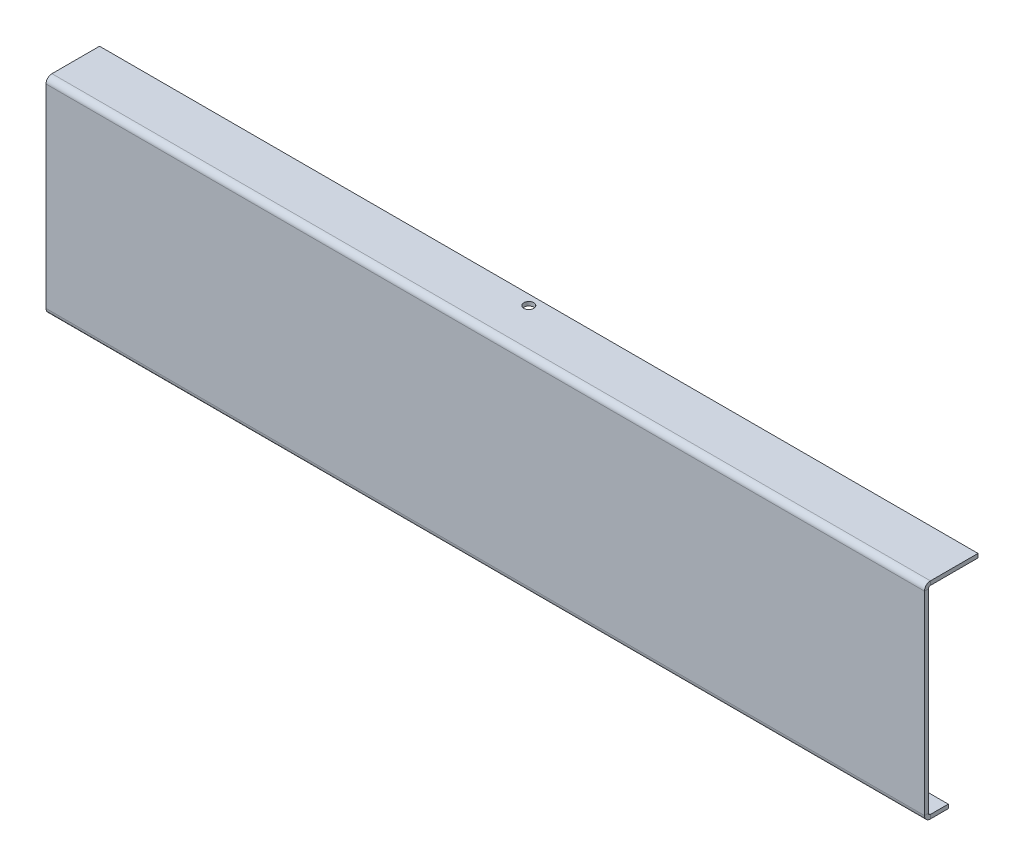
ISO-10303-21;
HEADER;
FILE_DESCRIPTION(('STEP AP214'),'2;1');
FILE_NAME('part.step','',(''),(''),'','','');
FILE_SCHEMA(('AUTOMOTIVE_DESIGN { 1 0 10303 214 1 1 1 1 }'));
ENDSEC;
DATA;
#1=APPLICATION_CONTEXT('core data for automotive mechanical design processes');
#2=APPLICATION_PROTOCOL_DEFINITION('international standard','automotive_design',2000,#1);
#3=PRODUCT_CONTEXT('',#1,'mechanical');
#4=PRODUCT('Part','Part','',(#3));
#5=PRODUCT_RELATED_PRODUCT_CATEGORY('part','',(#4));
#6=PRODUCT_DEFINITION_FORMATION('','',#4);
#7=PRODUCT_DEFINITION_CONTEXT('part definition',#1,'design');
#8=PRODUCT_DEFINITION('design','',#6,#7);
#9=PRODUCT_DEFINITION_SHAPE('','',#8);
#10=(LENGTH_UNIT() NAMED_UNIT(*) SI_UNIT(.MILLI.,.METRE.));
#11=(NAMED_UNIT(*) PLANE_ANGLE_UNIT() SI_UNIT($,.RADIAN.));
#12=(NAMED_UNIT(*) SI_UNIT($,.STERADIAN.) SOLID_ANGLE_UNIT());
#13=UNCERTAINTY_MEASURE_WITH_UNIT(LENGTH_MEASURE(1.E-05),#10,'distance_accuracy_value','');
#14=(GEOMETRIC_REPRESENTATION_CONTEXT(3) GLOBAL_UNCERTAINTY_ASSIGNED_CONTEXT((#13)) GLOBAL_UNIT_ASSIGNED_CONTEXT((#10,
#11,#12)) REPRESENTATION_CONTEXT('',''));
#15=CARTESIAN_POINT('',(0.,0.,0.));
#16=DIRECTION('',(0.,0.,1.));
#17=DIRECTION('',(1.,0.,0.));
#18=AXIS2_PLACEMENT_3D('',#15,#16,#17);
#19=CARTESIAN_POINT('',(0.,0.,-2.));
#20=DIRECTION('',(0.,0.,1.));
#21=DIRECTION('',(1.,0.,0.));
#22=AXIS2_PLACEMENT_3D('',#19,#20,#21);
#23=PLANE('',#22);
#24=DIRECTION('',(-1.,0.,0.));
#25=VECTOR('',#24,1.);
#26=CARTESIAN_POINT('',(-221.5,-49.,-2.));
#27=LINE('',#26,#25);
#28=CARTESIAN_POINT('',(-221.5,-49.,-2.));
#29=VERTEX_POINT('',#28);
#30=CARTESIAN_POINT('',(221.5,-49.,-2.));
#31=VERTEX_POINT('',#30);
#32=EDGE_CURVE('E224',#29,#31,#27,.F.);
#33=ORIENTED_EDGE('',*,*,#32,.F.);
#34=DIRECTION('',(0.,-1.,0.));
#35=VECTOR('',#34,1.);
#36=CARTESIAN_POINT('',(-221.5,50.,-2.));
#37=LINE('',#36,#35);
#38=CARTESIAN_POINT('',(-221.5,49.,-1.99999999999998));
#39=VERTEX_POINT('',#38);
#40=EDGE_CURVE('E12',#39,#29,#37,.T.);
#41=ORIENTED_EDGE('',*,*,#40,.F.);
#42=DIRECTION('',(1.,0.,0.));
#43=VECTOR('',#42,1.);
#44=CARTESIAN_POINT('',(221.5,49.,-1.99999999999998));
#45=LINE('',#44,#43);
#46=CARTESIAN_POINT('',(221.5,49.,-1.99999999999998));
#47=VERTEX_POINT('',#46);
#48=EDGE_CURVE('E115',#47,#39,#45,.F.);
#49=ORIENTED_EDGE('',*,*,#48,.F.);
#50=DIRECTION('',(0.,1.,0.));
#51=VECTOR('',#50,1.);
#52=CARTESIAN_POINT('',(221.5,50.,-2.));
#53=LINE('',#52,#51);
#54=EDGE_CURVE('E54',#31,#47,#53,.T.);
#55=ORIENTED_EDGE('',*,*,#54,.F.);
#56=EDGE_LOOP('',(#33,#41,#49,#55));
#57=FACE_BOUND('',#56,.T.);
#58=ADVANCED_FACE('F44',(#57),#23,.F.);
#59=CARTESIAN_POINT('',(0.,0.,0.));
#60=DIRECTION('',(0.,0.,1.));
#61=DIRECTION('',(1.,0.,0.));
#62=AXIS2_PLACEMENT_3D('',#59,#60,#61);
#63=PLANE('',#62);
#64=DIRECTION('',(0.,-1.,0.));
#65=VECTOR('',#64,1.);
#66=CARTESIAN_POINT('',(-221.5,50.,0.));
#67=LINE('',#66,#65);
#68=CARTESIAN_POINT('',(-221.5,49.,0.));
#69=VERTEX_POINT('',#68);
#70=CARTESIAN_POINT('',(-221.5,-49.,0.));
#71=VERTEX_POINT('',#70);
#72=EDGE_CURVE('E185',#69,#71,#67,.T.);
#73=ORIENTED_EDGE('',*,*,#72,.T.);
#74=DIRECTION('',(-1.,0.,0.));
#75=VECTOR('',#74,1.);
#76=CARTESIAN_POINT('',(-221.5,-49.,0.));
#77=LINE('',#76,#75);
#78=CARTESIAN_POINT('',(221.5,-49.,0.));
#79=VERTEX_POINT('',#78);
#80=EDGE_CURVE('E196',#71,#79,#77,.F.);
#81=ORIENTED_EDGE('',*,*,#80,.T.);
#82=DIRECTION('',(0.,1.,0.));
#83=VECTOR('',#82,1.);
#84=CARTESIAN_POINT('',(221.5,50.,0.));
#85=LINE('',#84,#83);
#86=CARTESIAN_POINT('',(221.5,49.,0.));
#87=VERTEX_POINT('',#86);
#88=EDGE_CURVE('E71',#79,#87,#85,.T.);
#89=ORIENTED_EDGE('',*,*,#88,.T.);
#90=DIRECTION('',(1.,0.,0.));
#91=VECTOR('',#90,1.);
#92=CARTESIAN_POINT('',(221.5,49.,0.));
#93=LINE('',#92,#91);
#94=EDGE_CURVE('E167',#87,#69,#93,.F.);
#95=ORIENTED_EDGE('',*,*,#94,.T.);
#96=EDGE_LOOP('',(#73,#81,#89,#95));
#97=FACE_BOUND('',#96,.T.);
#98=ADVANCED_FACE('F193',(#97),#63,.T.);
#99=CARTESIAN_POINT('',(-221.5,50.,-2.));
#100=DIRECTION('',(-1.,0.,0.));
#101=DIRECTION('',(0.,0.,1.));
#102=AXIS2_PLACEMENT_3D('',#99,#100,#101);
#103=PLANE('',#102);
#104=ORIENTED_EDGE('',*,*,#40,.T.);
#105=DIRECTION('',(0.,0.,1.));
#106=VECTOR('',#105,1.);
#107=CARTESIAN_POINT('',(-221.5,-49.,-2.));
#108=LINE('',#107,#106);
#109=EDGE_CURVE('E205',#29,#71,#108,.T.);
#110=ORIENTED_EDGE('',*,*,#109,.T.);
#111=ORIENTED_EDGE('',*,*,#72,.F.);
#112=DIRECTION('',(0.,0.,1.));
#113=VECTOR('',#112,1.);
#114=CARTESIAN_POINT('',(-221.5,49.,-1.99999999999998));
#115=LINE('',#114,#113);
#116=EDGE_CURVE('E179',#39,#69,#115,.T.);
#117=ORIENTED_EDGE('',*,*,#116,.F.);
#118=EDGE_LOOP('',(#104,#110,#111,#117));
#119=FACE_BOUND('',#118,.T.);
#120=ADVANCED_FACE('F202',(#119),#103,.T.);
#121=CARTESIAN_POINT('',(221.5,50.,-2.));
#122=DIRECTION('',(1.,0.,0.));
#123=DIRECTION('',(0.,1.,0.));
#124=AXIS2_PLACEMENT_3D('',#121,#122,#123);
#125=PLANE('',#124);
#126=DIRECTION('',(0.,0.,1.));
#127=VECTOR('',#126,1.);
#128=CARTESIAN_POINT('',(221.5,-49.,-2.));
#129=LINE('',#128,#127);
#130=EDGE_CURVE('E145',#31,#79,#129,.T.);
#131=ORIENTED_EDGE('',*,*,#130,.F.);
#132=ORIENTED_EDGE('',*,*,#54,.T.);
#133=DIRECTION('',(0.,0.,1.));
#134=VECTOR('',#133,1.);
#135=CARTESIAN_POINT('',(221.5,49.,-1.99999999999998));
#136=LINE('',#135,#134);
#137=EDGE_CURVE('E113',#47,#87,#136,.T.);
#138=ORIENTED_EDGE('',*,*,#137,.T.);
#139=ORIENTED_EDGE('',*,*,#88,.F.);
#140=EDGE_LOOP('',(#131,#132,#138,#139));
#141=FACE_BOUND('',#140,.T.);
#142=ADVANCED_FACE('F46',(#141),#125,.T.);
#143=CARTESIAN_POINT('',(-221.5,49.,-2.99999999999999));
#144=DIRECTION('',(-1.,0.,0.));
#145=DIRECTION('',(0.,0.,1.));
#146=AXIS2_PLACEMENT_3D('',#143,#144,#145);
#147=PLANE('',#146);
#148=DIRECTION('',(0.,1.,0.));
#149=VECTOR('',#148,1.);
#150=CARTESIAN_POINT('',(-221.5,50.,-3.));
#151=LINE('',#150,#149);
#152=CARTESIAN_POINT('',(-221.5,50.,-2.99999999999999));
#153=VERTEX_POINT('',#152);
#154=CARTESIAN_POINT('',(-221.5,52.,-2.99999999999998));
#155=VERTEX_POINT('',#154);
#156=EDGE_CURVE('E103',#153,#155,#151,.T.);
#157=ORIENTED_EDGE('',*,*,#156,.F.);
#158=CARTESIAN_POINT('',(-221.5,49.,-2.99999999999999));
#159=DIRECTION('',(1.,0.,0.));
#160=DIRECTION('',(0.,0.,-1.));
#161=AXIS2_PLACEMENT_3D('',#158,#159,#160);
#162=CIRCLE('',#161,1.00000000000001);
#163=EDGE_CURVE('E96',#39,#153,#162,.F.);
#164=ORIENTED_EDGE('',*,*,#163,.F.);
#165=ORIENTED_EDGE('',*,*,#116,.T.);
#166=CARTESIAN_POINT('',(-221.5,49.,-2.99999999999999));
#167=DIRECTION('',(1.,0.,0.));
#168=DIRECTION('',(0.,0.,-1.));
#169=AXIS2_PLACEMENT_3D('',#166,#167,#168);
#170=CIRCLE('',#169,3.00000000000001);
#171=EDGE_CURVE('E62',#69,#155,#170,.F.);
#172=ORIENTED_EDGE('',*,*,#171,.T.);
#173=EDGE_LOOP('',(#157,#164,#165,#172));
#174=FACE_BOUND('',#173,.T.);
#175=ADVANCED_FACE('F322',(#174),#147,.T.);
#176=CARTESIAN_POINT('',(221.5,49.,-2.99999999999999));
#177=DIRECTION('',(-1.,0.,0.));
#178=DIRECTION('',(0.,0.,1.));
#179=AXIS2_PLACEMENT_3D('',#176,#177,#178);
#180=PLANE('',#179);
#181=CARTESIAN_POINT('',(221.5,49.,-2.99999999999999));
#182=DIRECTION('',(1.,0.,0.));
#183=DIRECTION('',(0.,0.,-1.));
#184=AXIS2_PLACEMENT_3D('',#181,#182,#183);
#185=CIRCLE('',#184,1.00000000000001);
#186=CARTESIAN_POINT('',(221.5,50.,-2.99999999999999));
#187=VERTEX_POINT('',#186);
#188=EDGE_CURVE('E93',#187,#47,#185,.T.);
#189=ORIENTED_EDGE('',*,*,#188,.F.);
#190=DIRECTION('',(0.,1.,0.));
#191=VECTOR('',#190,1.);
#192=CARTESIAN_POINT('',(221.5,50.,-2.99999999999998));
#193=LINE('',#192,#191);
#194=CARTESIAN_POINT('',(221.5,52.,-2.99999999999998));
#195=VERTEX_POINT('',#194);
#196=EDGE_CURVE('E102',#187,#195,#193,.T.);
#197=ORIENTED_EDGE('',*,*,#196,.T.);
#198=CARTESIAN_POINT('',(221.5,49.,-2.99999999999999));
#199=DIRECTION('',(1.,0.,0.));
#200=DIRECTION('',(0.,0.,-1.));
#201=AXIS2_PLACEMENT_3D('',#198,#199,#200);
#202=CIRCLE('',#201,3.00000000000001);
#203=EDGE_CURVE('E170',#195,#87,#202,.T.);
#204=ORIENTED_EDGE('',*,*,#203,.T.);
#205=ORIENTED_EDGE('',*,*,#137,.F.);
#206=EDGE_LOOP('',(#189,#197,#204,#205));
#207=FACE_BOUND('',#206,.T.);
#208=ADVANCED_FACE('F108',(#207),#180,.F.);
#209=CARTESIAN_POINT('',(221.5,49.,-2.99999999999999));
#210=DIRECTION('',(1.,0.,0.));
#211=DIRECTION('',(0.,1.,0.));
#212=AXIS2_PLACEMENT_3D('',#209,#210,#211);
#213=CYLINDRICAL_SURFACE('',#212,3.00000000000001);
#214=ORIENTED_EDGE('',*,*,#94,.F.);
#215=ORIENTED_EDGE('',*,*,#203,.F.);
#216=DIRECTION('',(1.,0.,0.));
#217=VECTOR('',#216,1.);
#218=CARTESIAN_POINT('',(0.,52.,-2.99999999999998));
#219=LINE('',#218,#217);
#220=EDGE_CURVE('E135',#155,#195,#219,.T.);
#221=ORIENTED_EDGE('',*,*,#220,.F.);
#222=ORIENTED_EDGE('',*,*,#171,.F.);
#223=EDGE_LOOP('',(#214,#215,#221,#222));
#224=FACE_BOUND('',#223,.T.);
#225=ADVANCED_FACE('F415',(#224),#213,.T.);
#226=CARTESIAN_POINT('',(221.5,49.,-2.99999999999999));
#227=DIRECTION('',(1.,0.,0.));
#228=DIRECTION('',(0.,1.,0.));
#229=AXIS2_PLACEMENT_3D('',#226,#227,#228);
#230=CYLINDRICAL_SURFACE('',#229,1.00000000000001);
#231=ORIENTED_EDGE('',*,*,#48,.T.);
#232=ORIENTED_EDGE('',*,*,#163,.T.);
#233=DIRECTION('',(1.,0.,0.));
#234=VECTOR('',#233,1.);
#235=CARTESIAN_POINT('',(-221.5,50.,-3.));
#236=LINE('',#235,#234);
#237=EDGE_CURVE('E90',#153,#187,#236,.T.);
#238=ORIENTED_EDGE('',*,*,#237,.T.);
#239=ORIENTED_EDGE('',*,*,#188,.T.);
#240=EDGE_LOOP('',(#231,#232,#238,#239));
#241=FACE_BOUND('',#240,.T.);
#242=ADVANCED_FACE('F92',(#241),#230,.F.);
#243=CARTESIAN_POINT('',(221.5,52.,-1.99999999999999));
#244=DIRECTION('',(1.,0.,0.));
#245=DIRECTION('',(0.,0.,-1.));
#246=AXIS2_PLACEMENT_3D('',#243,#244,#245);
#247=PLANE('',#246);
#248=DIRECTION('',(0.,0.,1.));
#249=VECTOR('',#248,1.);
#250=CARTESIAN_POINT('',(221.5,52.,-1.99999999999999));
#251=LINE('',#250,#249);
#252=CARTESIAN_POINT('',(221.5,52.0000000000001,-27.));
#253=VERTEX_POINT('',#252);
#254=EDGE_CURVE('E133',#253,#195,#251,.T.);
#255=ORIENTED_EDGE('',*,*,#254,.T.);
#256=ORIENTED_EDGE('',*,*,#196,.F.);
#257=DIRECTION('',(0.,0.,1.));
#258=VECTOR('',#257,1.);
#259=CARTESIAN_POINT('',(221.5,50.,-2.));
#260=LINE('',#259,#258);
#261=CARTESIAN_POINT('',(221.5,50.0000000000001,-27.));
#262=VERTEX_POINT('',#261);
#263=EDGE_CURVE('E120',#262,#187,#260,.T.);
#264=ORIENTED_EDGE('',*,*,#263,.F.);
#265=DIRECTION('',(0.,-1.,0.));
#266=VECTOR('',#265,1.);
#267=CARTESIAN_POINT('',(221.5,52.0000000000001,-27.));
#268=LINE('',#267,#266);
#269=EDGE_CURVE('E116',#253,#262,#268,.T.);
#270=ORIENTED_EDGE('',*,*,#269,.F.);
#271=EDGE_LOOP('',(#255,#256,#264,#270));
#272=FACE_BOUND('',#271,.T.);
#273=ADVANCED_FACE('F131',(#272),#247,.T.);
#274=CARTESIAN_POINT('',(-221.5,52.0000000000001,-27.));
#275=DIRECTION('',(-1.,0.,0.));
#276=DIRECTION('',(0.,0.,1.));
#277=AXIS2_PLACEMENT_3D('',#274,#275,#276);
#278=PLANE('',#277);
#279=DIRECTION('',(0.,0.,-1.));
#280=VECTOR('',#279,1.);
#281=CARTESIAN_POINT('',(-221.5,50.0000000000001,-27.));
#282=LINE('',#281,#280);
#283=CARTESIAN_POINT('',(-221.5,50.0000000000001,-27.));
#284=VERTEX_POINT('',#283);
#285=EDGE_CURVE('E139',#153,#284,#282,.T.);
#286=ORIENTED_EDGE('',*,*,#285,.F.);
#287=ORIENTED_EDGE('',*,*,#156,.T.);
#288=DIRECTION('',(0.,0.,-1.));
#289=VECTOR('',#288,1.);
#290=CARTESIAN_POINT('',(-221.5,52.0000000000001,-27.));
#291=LINE('',#290,#289);
#292=CARTESIAN_POINT('',(-221.5,52.0000000000001,-27.));
#293=VERTEX_POINT('',#292);
#294=EDGE_CURVE('E128',#155,#293,#291,.T.);
#295=ORIENTED_EDGE('',*,*,#294,.T.);
#296=DIRECTION('',(0.,-1.,0.));
#297=VECTOR('',#296,1.);
#298=CARTESIAN_POINT('',(-221.5,52.0000000000001,-27.));
#299=LINE('',#298,#297);
#300=EDGE_CURVE('E156',#293,#284,#299,.T.);
#301=ORIENTED_EDGE('',*,*,#300,.T.);
#302=EDGE_LOOP('',(#286,#287,#295,#301));
#303=FACE_BOUND('',#302,.T.);
#304=ADVANCED_FACE('F336',(#303),#278,.T.);
#305=CARTESIAN_POINT('',(0.,52.,1.87394204179274E-13));
#306=DIRECTION('',(0.,1.,0.));
#307=DIRECTION('',(0.,0.,1.));
#308=AXIS2_PLACEMENT_3D('',#305,#306,#307);
#309=PLANE('',#308);
#310=CARTESIAN_POINT('',(0.,52.0000000000001,-22.));
#311=DIRECTION('',(0.,1.,0.));
#312=DIRECTION('',(0.,0.,1.));
#313=AXIS2_PLACEMENT_3D('',#310,#311,#312);
#314=CIRCLE('',#313,2.5);
#315=CARTESIAN_POINT('',(0.,52.0000000000001,-19.5));
#316=VERTEX_POINT('',#315);
#317=EDGE_CURVE('E285',#316,#316,#314,.T.);
#318=ORIENTED_EDGE('',*,*,#317,.F.);
#319=EDGE_LOOP('',(#318));
#320=FACE_BOUND('',#319,.T.);
#321=ORIENTED_EDGE('',*,*,#294,.F.);
#322=ORIENTED_EDGE('',*,*,#220,.T.);
#323=ORIENTED_EDGE('',*,*,#254,.F.);
#324=DIRECTION('',(1.,0.,0.));
#325=VECTOR('',#324,1.);
#326=CARTESIAN_POINT('',(221.5,52.0000000000001,-27.));
#327=LINE('',#326,#325);
#328=EDGE_CURVE('E150',#293,#253,#327,.T.);
#329=ORIENTED_EDGE('',*,*,#328,.F.);
#330=EDGE_LOOP('',(#321,#322,#323,#329));
#331=FACE_BOUND('',#330,.T.);
#332=ADVANCED_FACE('F341',(#320,#331),#309,.T.);
#333=CARTESIAN_POINT('',(0.,50.,1.80411241501588E-13));
#334=DIRECTION('',(0.,1.,0.));
#335=DIRECTION('',(0.,0.,1.));
#336=AXIS2_PLACEMENT_3D('',#333,#334,#335);
#337=PLANE('',#336);
#338=CARTESIAN_POINT('',(0.,50.0000000000001,-22.));
#339=DIRECTION('',(0.,1.,0.));
#340=DIRECTION('',(0.,0.,1.));
#341=AXIS2_PLACEMENT_3D('',#338,#339,#340);
#342=CIRCLE('',#341,2.5);
#343=CARTESIAN_POINT('',(0.,50.0000000000001,-19.5));
#344=VERTEX_POINT('',#343);
#345=EDGE_CURVE('E48',#344,#344,#342,.T.);
#346=ORIENTED_EDGE('',*,*,#345,.T.);
#347=EDGE_LOOP('',(#346));
#348=FACE_BOUND('',#347,.T.);
#349=ORIENTED_EDGE('',*,*,#237,.F.);
#350=ORIENTED_EDGE('',*,*,#285,.T.);
#351=DIRECTION('',(1.,0.,0.));
#352=VECTOR('',#351,1.);
#353=CARTESIAN_POINT('',(221.5,50.0000000000001,-27.));
#354=LINE('',#353,#352);
#355=EDGE_CURVE('E124',#284,#262,#354,.T.);
#356=ORIENTED_EDGE('',*,*,#355,.T.);
#357=ORIENTED_EDGE('',*,*,#263,.T.);
#358=EDGE_LOOP('',(#349,#350,#356,#357));
#359=FACE_BOUND('',#358,.T.);
#360=ADVANCED_FACE('F121',(#348,#359),#337,.F.);
#361=CARTESIAN_POINT('',(221.5,52.0000000000001,-27.));
#362=DIRECTION('',(0.,0.,-1.));
#363=DIRECTION('',(0.,1.,0.));
#364=AXIS2_PLACEMENT_3D('',#361,#362,#363);
#365=PLANE('',#364);
#366=ORIENTED_EDGE('',*,*,#355,.F.);
#367=ORIENTED_EDGE('',*,*,#300,.F.);
#368=ORIENTED_EDGE('',*,*,#328,.T.);
#369=ORIENTED_EDGE('',*,*,#269,.T.);
#370=EDGE_LOOP('',(#366,#367,#368,#369));
#371=FACE_BOUND('',#370,.T.);
#372=ADVANCED_FACE('F345',(#371),#365,.T.);
#373=CARTESIAN_POINT('',(221.5,-49.,-3.00000000000001));
#374=DIRECTION('',(1.,0.,0.));
#375=DIRECTION('',(0.,0.,-1.));
#376=AXIS2_PLACEMENT_3D('',#373,#374,#375);
#377=PLANE('',#376);
#378=DIRECTION('',(0.,-1.,0.));
#379=VECTOR('',#378,1.);
#380=CARTESIAN_POINT('',(221.5,-50.,-3.));
#381=LINE('',#380,#379);
#382=CARTESIAN_POINT('',(221.5,-50.,-3.));
#383=VERTEX_POINT('',#382);
#384=CARTESIAN_POINT('',(221.5,-52.,-3.));
#385=VERTEX_POINT('',#384);
#386=EDGE_CURVE('E274',#383,#385,#381,.T.);
#387=ORIENTED_EDGE('',*,*,#386,.F.);
#388=CARTESIAN_POINT('',(221.5,-49.,-3.00000000000001));
#389=DIRECTION('',(-1.,0.,0.));
#390=DIRECTION('',(0.,0.,1.));
#391=AXIS2_PLACEMENT_3D('',#388,#389,#390);
#392=CIRCLE('',#391,1.00000000000001);
#393=EDGE_CURVE('E229',#31,#383,#392,.F.);
#394=ORIENTED_EDGE('',*,*,#393,.F.);
#395=ORIENTED_EDGE('',*,*,#130,.T.);
#396=CARTESIAN_POINT('',(221.5,-49.,-3.00000000000001));
#397=DIRECTION('',(-1.,0.,0.));
#398=DIRECTION('',(0.,0.,1.));
#399=AXIS2_PLACEMENT_3D('',#396,#397,#398);
#400=CIRCLE('',#399,3.00000000000001);
#401=EDGE_CURVE('E212',#79,#385,#400,.F.);
#402=ORIENTED_EDGE('',*,*,#401,.T.);
#403=EDGE_LOOP('',(#387,#394,#395,#402));
#404=FACE_BOUND('',#403,.T.);
#405=ADVANCED_FACE('F394',(#404),#377,.T.);
#406=CARTESIAN_POINT('',(-221.5,-49.,-3.00000000000001));
#407=DIRECTION('',(1.,0.,0.));
#408=DIRECTION('',(0.,0.,-1.));
#409=AXIS2_PLACEMENT_3D('',#406,#407,#408);
#410=PLANE('',#409);
#411=CARTESIAN_POINT('',(-221.5,-49.,-3.00000000000001));
#412=DIRECTION('',(-1.,0.,0.));
#413=DIRECTION('',(0.,0.,1.));
#414=AXIS2_PLACEMENT_3D('',#411,#412,#413);
#415=CIRCLE('',#414,1.00000000000001);
#416=CARTESIAN_POINT('',(-221.5,-50.,-3.));
#417=VERTEX_POINT('',#416);
#418=EDGE_CURVE('E221',#417,#29,#415,.T.);
#419=ORIENTED_EDGE('',*,*,#418,.F.);
#420=DIRECTION('',(0.,-1.,0.));
#421=VECTOR('',#420,1.);
#422=CARTESIAN_POINT('',(-221.5,-50.,-3.00000000000001));
#423=LINE('',#422,#421);
#424=CARTESIAN_POINT('',(-221.5,-52.,-3.));
#425=VERTEX_POINT('',#424);
#426=EDGE_CURVE('E273',#417,#425,#423,.T.);
#427=ORIENTED_EDGE('',*,*,#426,.T.);
#428=CARTESIAN_POINT('',(-221.5,-49.,-3.00000000000001));
#429=DIRECTION('',(-1.,0.,0.));
#430=DIRECTION('',(0.,0.,1.));
#431=AXIS2_PLACEMENT_3D('',#428,#429,#430);
#432=CIRCLE('',#431,3.00000000000001);
#433=EDGE_CURVE('E233',#425,#71,#432,.T.);
#434=ORIENTED_EDGE('',*,*,#433,.T.);
#435=ORIENTED_EDGE('',*,*,#109,.F.);
#436=EDGE_LOOP('',(#419,#427,#434,#435));
#437=FACE_BOUND('',#436,.T.);
#438=ADVANCED_FACE('F392',(#437),#410,.F.);
#439=CARTESIAN_POINT('',(-221.5,-49.,-3.00000000000001));
#440=DIRECTION('',(-1.,0.,0.));
#441=DIRECTION('',(0.,-1.,0.));
#442=AXIS2_PLACEMENT_3D('',#439,#440,#441);
#443=CYLINDRICAL_SURFACE('',#442,3.00000000000001);
#444=ORIENTED_EDGE('',*,*,#80,.F.);
#445=ORIENTED_EDGE('',*,*,#433,.F.);
#446=DIRECTION('',(-1.,0.,0.));
#447=VECTOR('',#446,1.);
#448=CARTESIAN_POINT('',(0.,-52.,-3.));
#449=LINE('',#448,#447);
#450=EDGE_CURVE('E259',#385,#425,#449,.T.);
#451=ORIENTED_EDGE('',*,*,#450,.F.);
#452=ORIENTED_EDGE('',*,*,#401,.F.);
#453=EDGE_LOOP('',(#444,#445,#451,#452));
#454=FACE_BOUND('',#453,.T.);
#455=ADVANCED_FACE('F393',(#454),#443,.T.);
#456=CARTESIAN_POINT('',(-221.5,-49.,-3.00000000000001));
#457=DIRECTION('',(-1.,0.,0.));
#458=DIRECTION('',(0.,-1.,0.));
#459=AXIS2_PLACEMENT_3D('',#456,#457,#458);
#460=CYLINDRICAL_SURFACE('',#459,1.00000000000001);
#461=ORIENTED_EDGE('',*,*,#32,.T.);
#462=ORIENTED_EDGE('',*,*,#393,.T.);
#463=DIRECTION('',(-1.,0.,0.));
#464=VECTOR('',#463,1.);
#465=CARTESIAN_POINT('',(221.5,-50.,-3.));
#466=LINE('',#465,#464);
#467=EDGE_CURVE('E278',#383,#417,#466,.T.);
#468=ORIENTED_EDGE('',*,*,#467,.T.);
#469=ORIENTED_EDGE('',*,*,#418,.T.);
#470=EDGE_LOOP('',(#461,#462,#468,#469));
#471=FACE_BOUND('',#470,.T.);
#472=ADVANCED_FACE('F391',(#471),#460,.F.);
#473=CARTESIAN_POINT('',(-221.5,-52.,-1.99999999999999));
#474=DIRECTION('',(-1.,0.,0.));
#475=DIRECTION('',(0.,0.,1.));
#476=AXIS2_PLACEMENT_3D('',#473,#474,#475);
#477=PLANE('',#476);
#478=DIRECTION('',(0.,0.,1.));
#479=VECTOR('',#478,1.);
#480=CARTESIAN_POINT('',(-221.5,-52.,-1.99999999999999));
#481=LINE('',#480,#479);
#482=CARTESIAN_POINT('',(-221.5,-52.,-12.));
#483=VERTEX_POINT('',#482);
#484=EDGE_CURVE('E242',#483,#425,#481,.T.);
#485=ORIENTED_EDGE('',*,*,#484,.T.);
#486=ORIENTED_EDGE('',*,*,#426,.F.);
#487=DIRECTION('',(0.,0.,1.));
#488=VECTOR('',#487,1.);
#489=CARTESIAN_POINT('',(-221.5,-50.,-2.));
#490=LINE('',#489,#488);
#491=CARTESIAN_POINT('',(-221.5,-50.,-12.));
#492=VERTEX_POINT('',#491);
#493=EDGE_CURVE('E246',#492,#417,#490,.T.);
#494=ORIENTED_EDGE('',*,*,#493,.F.);
#495=DIRECTION('',(0.,1.,0.));
#496=VECTOR('',#495,1.);
#497=CARTESIAN_POINT('',(-221.5,-52.,-12.));
#498=LINE('',#497,#496);
#499=EDGE_CURVE('E225',#483,#492,#498,.T.);
#500=ORIENTED_EDGE('',*,*,#499,.F.);
#501=EDGE_LOOP('',(#485,#486,#494,#500));
#502=FACE_BOUND('',#501,.T.);
#503=ADVANCED_FACE('F386',(#502),#477,.T.);
#504=CARTESIAN_POINT('',(221.5,-52.,-12.));
#505=DIRECTION('',(1.,0.,0.));
#506=DIRECTION('',(0.,0.,-1.));
#507=AXIS2_PLACEMENT_3D('',#504,#505,#506);
#508=PLANE('',#507);
#509=DIRECTION('',(0.,0.,-1.));
#510=VECTOR('',#509,1.);
#511=CARTESIAN_POINT('',(221.5,-50.,-12.));
#512=LINE('',#511,#510);
#513=CARTESIAN_POINT('',(221.5,-50.,-12.));
#514=VERTEX_POINT('',#513);
#515=EDGE_CURVE('E255',#383,#514,#512,.T.);
#516=ORIENTED_EDGE('',*,*,#515,.F.);
#517=ORIENTED_EDGE('',*,*,#386,.T.);
#518=DIRECTION('',(0.,0.,-1.));
#519=VECTOR('',#518,1.);
#520=CARTESIAN_POINT('',(221.5,-52.,-12.));
#521=LINE('',#520,#519);
#522=CARTESIAN_POINT('',(221.5,-52.,-12.));
#523=VERTEX_POINT('',#522);
#524=EDGE_CURVE('E250',#385,#523,#521,.T.);
#525=ORIENTED_EDGE('',*,*,#524,.T.);
#526=DIRECTION('',(0.,1.,0.));
#527=VECTOR('',#526,1.);
#528=CARTESIAN_POINT('',(221.5,-52.,-12.));
#529=LINE('',#528,#527);
#530=EDGE_CURVE('E238',#523,#514,#529,.T.);
#531=ORIENTED_EDGE('',*,*,#530,.T.);
#532=EDGE_LOOP('',(#516,#517,#525,#531));
#533=FACE_BOUND('',#532,.T.);
#534=ADVANCED_FACE('F378',(#533),#508,.T.);
#535=CARTESIAN_POINT('',(0.,-52.,1.80455310275367E-13));
#536=DIRECTION('',(0.,-1.,0.));
#537=DIRECTION('',(0.,0.,-1.));
#538=AXIS2_PLACEMENT_3D('',#535,#536,#537);
#539=PLANE('',#538);
#540=ORIENTED_EDGE('',*,*,#524,.F.);
#541=ORIENTED_EDGE('',*,*,#450,.T.);
#542=ORIENTED_EDGE('',*,*,#484,.F.);
#543=DIRECTION('',(-1.,0.,0.));
#544=VECTOR('',#543,1.);
#545=CARTESIAN_POINT('',(-221.5,-52.,-12.));
#546=LINE('',#545,#544);
#547=EDGE_CURVE('E263',#523,#483,#546,.T.);
#548=ORIENTED_EDGE('',*,*,#547,.F.);
#549=EDGE_LOOP('',(#540,#541,#542,#548));
#550=FACE_BOUND('',#549,.T.);
#551=ADVANCED_FACE('F383',(#550),#539,.T.);
#552=CARTESIAN_POINT('',(0.,-50.,1.73472347597681E-13));
#553=DIRECTION('',(0.,-1.,0.));
#554=DIRECTION('',(0.,0.,-1.));
#555=AXIS2_PLACEMENT_3D('',#552,#553,#554);
#556=PLANE('',#555);
#557=ORIENTED_EDGE('',*,*,#467,.F.);
#558=ORIENTED_EDGE('',*,*,#515,.T.);
#559=DIRECTION('',(-1.,0.,0.));
#560=VECTOR('',#559,1.);
#561=CARTESIAN_POINT('',(-221.5,-50.,-12.));
#562=LINE('',#561,#560);
#563=EDGE_CURVE('E251',#514,#492,#562,.T.);
#564=ORIENTED_EDGE('',*,*,#563,.T.);
#565=ORIENTED_EDGE('',*,*,#493,.T.);
#566=EDGE_LOOP('',(#557,#558,#564,#565));
#567=FACE_BOUND('',#566,.T.);
#568=ADVANCED_FACE('F304',(#567),#556,.F.);
#569=CARTESIAN_POINT('',(-221.5,-52.,-12.));
#570=DIRECTION('',(0.,0.,-1.));
#571=DIRECTION('',(0.,1.,0.));
#572=AXIS2_PLACEMENT_3D('',#569,#570,#571);
#573=PLANE('',#572);
#574=ORIENTED_EDGE('',*,*,#563,.F.);
#575=ORIENTED_EDGE('',*,*,#530,.F.);
#576=ORIENTED_EDGE('',*,*,#547,.T.);
#577=ORIENTED_EDGE('',*,*,#499,.T.);
#578=EDGE_LOOP('',(#574,#575,#576,#577));
#579=FACE_BOUND('',#578,.T.);
#580=ADVANCED_FACE('F299',(#579),#573,.T.);
#581=CARTESIAN_POINT('',(0.,42.0000000000001,-22.));
#582=DIRECTION('',(0.,1.,0.));
#583=DIRECTION('',(0.,0.,1.));
#584=AXIS2_PLACEMENT_3D('',#581,#582,#583);
#585=CYLINDRICAL_SURFACE('',#584,2.5);
#586=ORIENTED_EDGE('',*,*,#317,.T.);
#587=EDGE_LOOP('',(#586));
#588=FACE_BOUND('',#587,.T.);
#589=ORIENTED_EDGE('',*,*,#345,.F.);
#590=EDGE_LOOP('',(#589));
#591=FACE_BOUND('',#590,.T.);
#592=ADVANCED_FACE('F297',(#588,#591),#585,.F.);
#593=CLOSED_SHELL('',(#58,#98,#120,#142,#175,#208,#225,#242,#273,#304,#332,#360,#372,#405,#438,
#455,#472,#503,#534,#551,#568,#580,#592));
#594=MANIFOLD_SOLID_BREP('B2',#593);
#595=ADVANCED_BREP_SHAPE_REPRESENTATION('',(#18,#594),#14);
#596=SHAPE_DEFINITION_REPRESENTATION(#9,#595);
ENDSEC;
END-ISO-10303-21;
